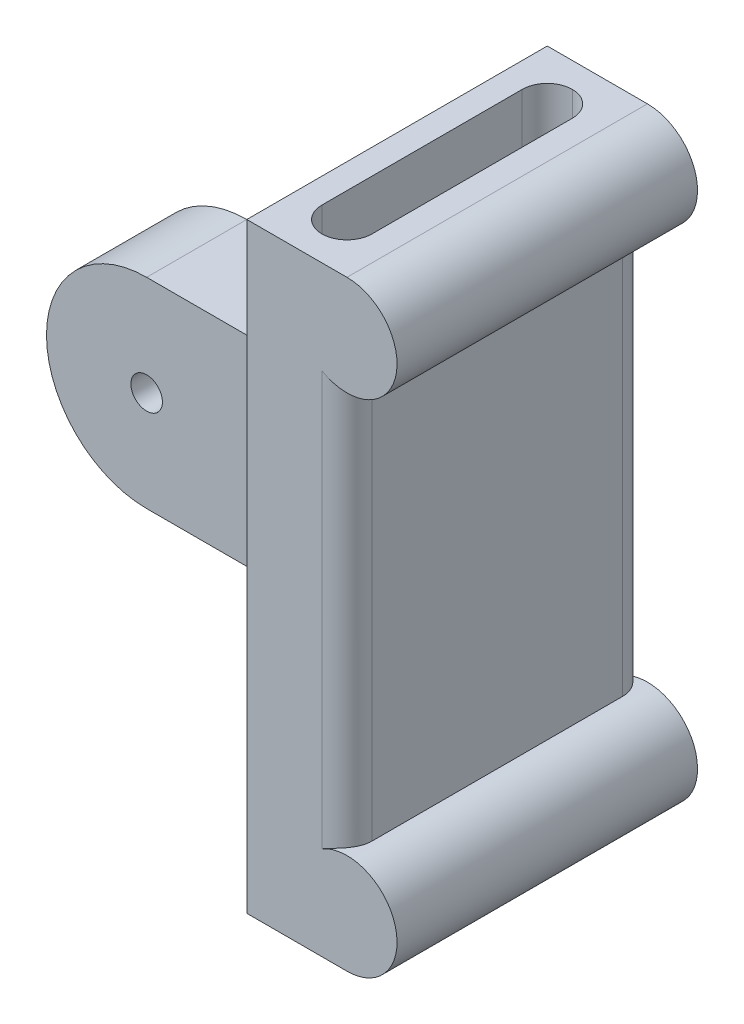
ISO-10303-21;
HEADER;
FILE_DESCRIPTION(('STEP AP214'),'2;1');
FILE_NAME('part.step','',(''),(''),'','','');
FILE_SCHEMA(('AUTOMOTIVE_DESIGN { 1 0 10303 214 1 1 1 1 }'));
ENDSEC;
DATA;
#1=APPLICATION_CONTEXT('core data for automotive mechanical design processes');
#2=APPLICATION_PROTOCOL_DEFINITION('international standard','automotive_design',2000,#1);
#3=PRODUCT_CONTEXT('',#1,'mechanical');
#4=PRODUCT('Part','Part','',(#3));
#5=PRODUCT_RELATED_PRODUCT_CATEGORY('part','',(#4));
#6=PRODUCT_DEFINITION_FORMATION('','',#4);
#7=PRODUCT_DEFINITION_CONTEXT('part definition',#1,'design');
#8=PRODUCT_DEFINITION('design','',#6,#7);
#9=PRODUCT_DEFINITION_SHAPE('','',#8);
#10=(LENGTH_UNIT() NAMED_UNIT(*) SI_UNIT(.MILLI.,.METRE.));
#11=(NAMED_UNIT(*) PLANE_ANGLE_UNIT() SI_UNIT($,.RADIAN.));
#12=(NAMED_UNIT(*) SI_UNIT($,.STERADIAN.) SOLID_ANGLE_UNIT());
#13=UNCERTAINTY_MEASURE_WITH_UNIT(LENGTH_MEASURE(1.E-05),#10,'distance_accuracy_value','');
#14=(GEOMETRIC_REPRESENTATION_CONTEXT(3) GLOBAL_UNCERTAINTY_ASSIGNED_CONTEXT((#13)) GLOBAL_UNIT_ASSIGNED_CONTEXT((#10,
#11,#12)) REPRESENTATION_CONTEXT('',''));
#15=CARTESIAN_POINT('',(0.,0.,0.));
#16=DIRECTION('',(0.,0.,1.));
#17=DIRECTION('',(1.,0.,0.));
#18=AXIS2_PLACEMENT_3D('',#15,#16,#17);
#19=CARTESIAN_POINT('',(25.4,0.,0.));
#20=DIRECTION('',(1.,0.,0.));
#21=DIRECTION('',(0.,0.,-1.));
#22=AXIS2_PLACEMENT_3D('',#19,#20,#21);
#23=PLANE('',#22);
#24=DIRECTION('',(0.,-1.,0.));
#25=VECTOR('',#24,1.);
#26=CARTESIAN_POINT('',(25.4,38.1,25.4));
#27=LINE('',#26,#25);
#28=CARTESIAN_POINT('',(25.4,-25.4,25.4));
#29=VERTEX_POINT('',#28);
#30=CARTESIAN_POINT('',(25.4,-38.1,25.4));
#31=VERTEX_POINT('',#30);
#32=EDGE_CURVE('E179',#29,#31,#27,.T.);
#33=ORIENTED_EDGE('',*,*,#32,.F.);
#34=DIRECTION('',(0.,0.,-1.));
#35=VECTOR('',#34,1.);
#36=CARTESIAN_POINT('',(25.4,-25.4,0.));
#37=LINE('',#36,#35);
#38=CARTESIAN_POINT('',(25.4,-25.4,-12.7));
#39=VERTEX_POINT('',#38);
#40=EDGE_CURVE('E278',#29,#39,#37,.T.);
#41=ORIENTED_EDGE('',*,*,#40,.T.);
#42=DIRECTION('',(0.,-1.,0.));
#43=VECTOR('',#42,1.);
#44=CARTESIAN_POINT('',(25.4,38.1,-12.7));
#45=LINE('',#44,#43);
#46=CARTESIAN_POINT('',(25.4,-38.1,-12.7));
#47=VERTEX_POINT('',#46);
#48=EDGE_CURVE('E237',#39,#47,#45,.T.);
#49=ORIENTED_EDGE('',*,*,#48,.T.);
#50=DIRECTION('',(0.,0.,-1.));
#51=VECTOR('',#50,1.);
#52=CARTESIAN_POINT('',(25.4,-38.1,25.4));
#53=LINE('',#52,#51);
#54=EDGE_CURVE('E234',#31,#47,#53,.T.);
#55=ORIENTED_EDGE('',*,*,#54,.F.);
#56=EDGE_LOOP('',(#33,#41,#49,#55));
#57=FACE_BOUND('',#56,.T.);
#58=ADVANCED_FACE('F34',(#57),#23,.F.);
#59=CARTESIAN_POINT('',(0.,0.,12.7));
#60=DIRECTION('',(0.,0.,-1.));
#61=DIRECTION('',(-1.,0.,0.));
#62=AXIS2_PLACEMENT_3D('',#59,#60,#61);
#63=CYLINDRICAL_SURFACE('',#62,12.7);
#64=CARTESIAN_POINT('',(0.,0.,0.));
#65=DIRECTION('',(0.,0.,1.));
#66=DIRECTION('',(1.,0.,0.));
#67=AXIS2_PLACEMENT_3D('',#64,#65,#66);
#68=CIRCLE('',#67,12.7);
#69=CARTESIAN_POINT('',(0.,12.7,0.));
#70=VERTEX_POINT('',#69);
#71=CARTESIAN_POINT('',(0.,-12.7,0.));
#72=VERTEX_POINT('',#71);
#73=EDGE_CURVE('E264',#70,#72,#68,.T.);
#74=ORIENTED_EDGE('',*,*,#73,.T.);
#75=DIRECTION('',(0.,0.,-1.));
#76=VECTOR('',#75,1.);
#77=CARTESIAN_POINT('',(0.,-12.7,12.7));
#78=LINE('',#77,#76);
#79=CARTESIAN_POINT('',(0.,-12.7,12.7));
#80=VERTEX_POINT('',#79);
#81=EDGE_CURVE('E273',#80,#72,#78,.T.);
#82=ORIENTED_EDGE('',*,*,#81,.F.);
#83=CARTESIAN_POINT('',(0.,0.,12.7));
#84=DIRECTION('',(0.,0.,1.));
#85=DIRECTION('',(1.,0.,0.));
#86=AXIS2_PLACEMENT_3D('',#83,#84,#85);
#87=CIRCLE('',#86,12.7);
#88=CARTESIAN_POINT('',(0.,12.7,12.7));
#89=VERTEX_POINT('',#88);
#90=EDGE_CURVE('E251',#89,#80,#87,.T.);
#91=ORIENTED_EDGE('',*,*,#90,.F.);
#92=DIRECTION('',(0.,0.,-1.));
#93=VECTOR('',#92,1.);
#94=CARTESIAN_POINT('',(0.,12.7,12.7));
#95=LINE('',#94,#93);
#96=EDGE_CURVE('E261',#89,#70,#95,.T.);
#97=ORIENTED_EDGE('',*,*,#96,.T.);
#98=EDGE_LOOP('',(#74,#82,#91,#97));
#99=FACE_BOUND('',#98,.T.);
#100=ADVANCED_FACE('F376',(#99),#63,.T.);
#101=CARTESIAN_POINT('',(0.,-12.7,12.7));
#102=DIRECTION('',(0.,1.,0.));
#103=DIRECTION('',(0.,0.,1.));
#104=AXIS2_PLACEMENT_3D('',#101,#102,#103);
#105=PLANE('',#104);
#106=DIRECTION('',(1.,0.,0.));
#107=VECTOR('',#106,1.);
#108=CARTESIAN_POINT('',(0.,-12.7,0.));
#109=LINE('',#108,#107);
#110=CARTESIAN_POINT('',(12.7,-12.7,0.));
#111=VERTEX_POINT('',#110);
#112=EDGE_CURVE('E267',#72,#111,#109,.T.);
#113=ORIENTED_EDGE('',*,*,#112,.T.);
#114=DIRECTION('',(0.,0.,-1.));
#115=VECTOR('',#114,1.);
#116=CARTESIAN_POINT('',(12.7,-12.7,12.7));
#117=LINE('',#116,#115);
#118=CARTESIAN_POINT('',(12.7,-12.7,12.7));
#119=VERTEX_POINT('',#118);
#120=EDGE_CURVE('E281',#111,#119,#117,.F.);
#121=ORIENTED_EDGE('',*,*,#120,.T.);
#122=DIRECTION('',(1.,0.,0.));
#123=VECTOR('',#122,1.);
#124=CARTESIAN_POINT('',(0.,-12.7,12.7));
#125=LINE('',#124,#123);
#126=EDGE_CURVE('E255',#80,#119,#125,.T.);
#127=ORIENTED_EDGE('',*,*,#126,.F.);
#128=ORIENTED_EDGE('',*,*,#81,.T.);
#129=EDGE_LOOP('',(#113,#121,#127,#128));
#130=FACE_BOUND('',#129,.T.);
#131=ADVANCED_FACE('F383',(#130),#105,.F.);
#132=CARTESIAN_POINT('',(0.,0.,12.7));
#133=DIRECTION('',(0.,0.,-1.));
#134=DIRECTION('',(-1.,0.,0.));
#135=AXIS2_PLACEMENT_3D('',#132,#133,#134);
#136=CYLINDRICAL_SURFACE('',#135,2.);
#137=CARTESIAN_POINT('',(0.,0.,12.7));
#138=DIRECTION('',(0.,0.,1.));
#139=DIRECTION('',(1.,0.,0.));
#140=AXIS2_PLACEMENT_3D('',#137,#138,#139);
#141=CIRCLE('',#140,2.);
#142=CARTESIAN_POINT('',(2.,0.,12.7));
#143=VERTEX_POINT('',#142);
#144=EDGE_CURVE('E248',#143,#143,#141,.T.);
#145=ORIENTED_EDGE('',*,*,#144,.T.);
#146=EDGE_LOOP('',(#145));
#147=FACE_BOUND('',#146,.T.);
#148=CARTESIAN_POINT('',(0.,0.,0.));
#149=DIRECTION('',(0.,0.,1.));
#150=DIRECTION('',(1.,0.,0.));
#151=AXIS2_PLACEMENT_3D('',#148,#149,#150);
#152=CIRCLE('',#151,2.);
#153=CARTESIAN_POINT('',(2.,0.,0.));
#154=VERTEX_POINT('',#153);
#155=EDGE_CURVE('E183',#154,#154,#152,.T.);
#156=ORIENTED_EDGE('',*,*,#155,.F.);
#157=EDGE_LOOP('',(#156));
#158=FACE_BOUND('',#157,.T.);
#159=ADVANCED_FACE('F434',(#147,#158),#136,.F.);
#160=CARTESIAN_POINT('',(0.,12.7,12.7));
#161=DIRECTION('',(0.,1.,0.));
#162=DIRECTION('',(0.,0.,1.));
#163=AXIS2_PLACEMENT_3D('',#160,#161,#162);
#164=PLANE('',#163);
#165=DIRECTION('',(1.,0.,0.));
#166=VECTOR('',#165,1.);
#167=CARTESIAN_POINT('',(0.,12.7,12.7));
#168=LINE('',#167,#166);
#169=CARTESIAN_POINT('',(12.7,12.7,12.7));
#170=VERTEX_POINT('',#169);
#171=EDGE_CURVE('E258',#89,#170,#168,.T.);
#172=ORIENTED_EDGE('',*,*,#171,.T.);
#173=DIRECTION('',(0.,0.,-1.));
#174=VECTOR('',#173,1.);
#175=CARTESIAN_POINT('',(12.7,12.7,12.7));
#176=LINE('',#175,#174);
#177=CARTESIAN_POINT('',(12.7,12.7,0.));
#178=VERTEX_POINT('',#177);
#179=EDGE_CURVE('E286',#170,#178,#176,.T.);
#180=ORIENTED_EDGE('',*,*,#179,.T.);
#181=DIRECTION('',(1.,0.,0.));
#182=VECTOR('',#181,1.);
#183=CARTESIAN_POINT('',(0.,12.7,0.));
#184=LINE('',#183,#182);
#185=EDGE_CURVE('E252',#70,#178,#184,.T.);
#186=ORIENTED_EDGE('',*,*,#185,.F.);
#187=ORIENTED_EDGE('',*,*,#96,.F.);
#188=EDGE_LOOP('',(#172,#180,#186,#187));
#189=FACE_BOUND('',#188,.T.);
#190=ADVANCED_FACE('F431',(#189),#164,.T.);
#191=CARTESIAN_POINT('',(0.,0.,12.7));
#192=DIRECTION('',(0.,0.,1.));
#193=DIRECTION('',(1.,0.,0.));
#194=AXIS2_PLACEMENT_3D('',#191,#192,#193);
#195=PLANE('',#194);
#196=ORIENTED_EDGE('',*,*,#144,.F.);
#197=EDGE_LOOP('',(#196));
#198=FACE_BOUND('',#197,.T.);
#199=ORIENTED_EDGE('',*,*,#126,.T.);
#200=DIRECTION('',(0.,1.,0.));
#201=VECTOR('',#200,1.);
#202=CARTESIAN_POINT('',(12.7,0.,12.7));
#203=LINE('',#202,#201);
#204=EDGE_CURVE('E284',#119,#170,#203,.T.);
#205=ORIENTED_EDGE('',*,*,#204,.T.);
#206=ORIENTED_EDGE('',*,*,#171,.F.);
#207=ORIENTED_EDGE('',*,*,#90,.T.);
#208=EDGE_LOOP('',(#199,#205,#206,#207));
#209=FACE_BOUND('',#208,.T.);
#210=ADVANCED_FACE('F396',(#198,#209),#195,.T.);
#211=CARTESIAN_POINT('',(0.,0.,0.));
#212=DIRECTION('',(0.,0.,1.));
#213=DIRECTION('',(1.,0.,0.));
#214=AXIS2_PLACEMENT_3D('',#211,#212,#213);
#215=PLANE('',#214);
#216=ORIENTED_EDGE('',*,*,#155,.T.);
#217=EDGE_LOOP('',(#216));
#218=FACE_BOUND('',#217,.T.);
#219=ORIENTED_EDGE('',*,*,#185,.T.);
#220=DIRECTION('',(0.,1.,0.));
#221=VECTOR('',#220,1.);
#222=CARTESIAN_POINT('',(12.7,-12.7,0.));
#223=LINE('',#222,#221);
#224=EDGE_CURVE('E288',#178,#111,#223,.F.);
#225=ORIENTED_EDGE('',*,*,#224,.T.);
#226=ORIENTED_EDGE('',*,*,#112,.F.);
#227=ORIENTED_EDGE('',*,*,#73,.F.);
#228=EDGE_LOOP('',(#219,#225,#226,#227));
#229=FACE_BOUND('',#228,.T.);
#230=ADVANCED_FACE('F389',(#218,#229),#215,.F.);
#231=CARTESIAN_POINT('',(25.4,38.1,-12.7));
#232=VERTEX_POINT('',#231);
#233=CARTESIAN_POINT('',(25.4,25.4,-12.7));
#234=VERTEX_POINT('',#233);
#235=EDGE_CURVE('E238',#232,#234,#45,.T.);
#236=ORIENTED_EDGE('',*,*,#235,.T.);
#237=DIRECTION('',(0.,0.,-1.));
#238=VECTOR('',#237,1.);
#239=CARTESIAN_POINT('',(25.4,25.4,0.));
#240=LINE('',#239,#238);
#241=CARTESIAN_POINT('',(25.4,25.4,25.4));
#242=VERTEX_POINT('',#241);
#243=EDGE_CURVE('E276',#234,#242,#240,.F.);
#244=ORIENTED_EDGE('',*,*,#243,.T.);
#245=CARTESIAN_POINT('',(25.4,38.1,25.4));
#246=VERTEX_POINT('',#245);
#247=EDGE_CURVE('E231',#246,#242,#27,.T.);
#248=ORIENTED_EDGE('',*,*,#247,.F.);
#249=DIRECTION('',(0.,0.,-1.));
#250=VECTOR('',#249,1.);
#251=CARTESIAN_POINT('',(25.4,38.1,25.4));
#252=LINE('',#251,#250);
#253=EDGE_CURVE('E193',#246,#232,#252,.T.);
#254=ORIENTED_EDGE('',*,*,#253,.T.);
#255=EDGE_LOOP('',(#236,#244,#248,#254));
#256=FACE_BOUND('',#255,.T.);
#257=ADVANCED_FACE('F379',(#256),#23,.F.);
#258=CARTESIAN_POINT('',(38.1,38.1,25.4));
#259=DIRECTION('',(0.,0.,-1.));
#260=DIRECTION('',(0.,1.,0.));
#261=AXIS2_PLACEMENT_3D('',#258,#259,#260);
#262=PLANE('',#261);
#263=CARTESIAN_POINT('',(38.1,-31.75,25.4));
#264=DIRECTION('',(0.,0.,1.));
#265=DIRECTION('',(1.,0.,0.));
#266=AXIS2_PLACEMENT_3D('',#263,#264,#265);
#267=CIRCLE('',#266,6.35);
#268=CARTESIAN_POINT('',(38.1,-38.1,25.4));
#269=VERTEX_POINT('',#268);
#270=CARTESIAN_POINT('',(34.925,-26.2507386859688,25.4));
#271=VERTEX_POINT('',#270);
#272=EDGE_CURVE('E176',#269,#271,#267,.T.);
#273=ORIENTED_EDGE('',*,*,#272,.T.);
#274=DIRECTION('',(0.,-1.,0.));
#275=VECTOR('',#274,1.);
#276=CARTESIAN_POINT('',(34.925,25.4,25.4));
#277=LINE('',#276,#275);
#278=CARTESIAN_POINT('',(34.925,26.2507386859688,25.4));
#279=VERTEX_POINT('',#278);
#280=EDGE_CURVE('E304',#271,#279,#277,.F.);
#281=ORIENTED_EDGE('',*,*,#280,.T.);
#282=CARTESIAN_POINT('',(38.1,31.75,25.4));
#283=DIRECTION('',(0.,0.,1.));
#284=DIRECTION('',(-1.,0.,0.));
#285=AXIS2_PLACEMENT_3D('',#282,#283,#284);
#286=CIRCLE('',#285,6.35);
#287=CARTESIAN_POINT('',(38.1,38.1,25.4));
#288=VERTEX_POINT('',#287);
#289=EDGE_CURVE('E207',#279,#288,#286,.T.);
#290=ORIENTED_EDGE('',*,*,#289,.T.);
#291=DIRECTION('',(-1.,0.,0.));
#292=VECTOR('',#291,1.);
#293=CARTESIAN_POINT('',(38.1,38.1,25.4));
#294=LINE('',#293,#292);
#295=EDGE_CURVE('E230',#288,#246,#294,.T.);
#296=ORIENTED_EDGE('',*,*,#295,.T.);
#297=ORIENTED_EDGE('',*,*,#247,.T.);
#298=EDGE_CURVE('E235',#242,#29,#27,.T.);
#299=ORIENTED_EDGE('',*,*,#298,.T.);
#300=ORIENTED_EDGE('',*,*,#32,.T.);
#301=DIRECTION('',(-1.,0.,0.));
#302=VECTOR('',#301,1.);
#303=CARTESIAN_POINT('',(38.1,-38.1,25.4));
#304=LINE('',#303,#302);
#305=EDGE_CURVE('E171',#269,#31,#304,.T.);
#306=ORIENTED_EDGE('',*,*,#305,.F.);
#307=EDGE_LOOP('',(#273,#281,#290,#296,#297,#299,#300,#306));
#308=FACE_BOUND('',#307,.T.);
#309=ADVANCED_FACE('F173',(#308),#262,.F.);
#310=CARTESIAN_POINT('',(38.1,-38.1,25.4));
#311=DIRECTION('',(0.,1.,0.));
#312=DIRECTION('',(0.,0.,1.));
#313=AXIS2_PLACEMENT_3D('',#310,#311,#312);
#314=PLANE('',#313);
#315=CARTESIAN_POINT('',(31.75,-38.1,-6.35));
#316=DIRECTION('',(0.,1.,0.));
#317=DIRECTION('',(0.,0.,1.));
#318=AXIS2_PLACEMENT_3D('',#315,#316,#317);
#319=CIRCLE('',#318,3.175);
#320=CARTESIAN_POINT('',(34.925,-38.1,-6.35));
#321=VERTEX_POINT('',#320);
#322=CARTESIAN_POINT('',(31.75,-38.1,-9.525));
#323=VERTEX_POINT('',#322);
#324=EDGE_CURVE('E50',#321,#323,#319,.T.);
#325=ORIENTED_EDGE('',*,*,#324,.T.);
#326=CARTESIAN_POINT('',(31.75,-38.1,-6.35));
#327=DIRECTION('',(0.,1.,0.));
#328=DIRECTION('',(0.,0.,1.));
#329=AXIS2_PLACEMENT_3D('',#326,#327,#328);
#330=CIRCLE('',#329,3.175);
#331=CARTESIAN_POINT('',(28.575,-38.1,-6.35));
#332=VERTEX_POINT('',#331);
#333=EDGE_CURVE('E11',#323,#332,#330,.T.);
#334=ORIENTED_EDGE('',*,*,#333,.T.);
#335=DIRECTION('',(0.,0.,1.));
#336=VECTOR('',#335,1.);
#337=CARTESIAN_POINT('',(28.575,-38.1,-9.525));
#338=LINE('',#337,#336);
#339=CARTESIAN_POINT('',(28.575,-38.1,19.05));
#340=VERTEX_POINT('',#339);
#341=EDGE_CURVE('E217',#332,#340,#338,.T.);
#342=ORIENTED_EDGE('',*,*,#341,.T.);
#343=CARTESIAN_POINT('',(31.75,-38.1,19.05));
#344=DIRECTION('',(0.,1.,0.));
#345=DIRECTION('',(0.,0.,1.));
#346=AXIS2_PLACEMENT_3D('',#343,#344,#345);
#347=CIRCLE('',#346,3.175);
#348=CARTESIAN_POINT('',(31.75,-38.1,22.225));
#349=VERTEX_POINT('',#348);
#350=EDGE_CURVE('E488',#340,#349,#347,.T.);
#351=ORIENTED_EDGE('',*,*,#350,.T.);
#352=CARTESIAN_POINT('',(31.75,-38.1,19.05));
#353=DIRECTION('',(0.,1.,0.));
#354=DIRECTION('',(0.,0.,1.));
#355=AXIS2_PLACEMENT_3D('',#352,#353,#354);
#356=CIRCLE('',#355,3.175);
#357=CARTESIAN_POINT('',(34.925,-38.1,19.05));
#358=VERTEX_POINT('',#357);
#359=EDGE_CURVE('E479',#349,#358,#356,.T.);
#360=ORIENTED_EDGE('',*,*,#359,.T.);
#361=DIRECTION('',(0.,0.,-1.));
#362=VECTOR('',#361,1.);
#363=CARTESIAN_POINT('',(34.925,-38.1,-9.525));
#364=LINE('',#363,#362);
#365=EDGE_CURVE('E220',#358,#321,#364,.T.);
#366=ORIENTED_EDGE('',*,*,#365,.T.);
#367=EDGE_LOOP('',(#325,#334,#342,#351,#360,#366));
#368=FACE_BOUND('',#367,.T.);
#369=ORIENTED_EDGE('',*,*,#54,.T.);
#370=DIRECTION('',(-1.,0.,0.));
#371=VECTOR('',#370,1.);
#372=CARTESIAN_POINT('',(38.1,-38.1,-12.7));
#373=LINE('',#372,#371);
#374=CARTESIAN_POINT('',(38.1,-38.1,-12.7));
#375=VERTEX_POINT('',#374);
#376=EDGE_CURVE('E184',#375,#47,#373,.T.);
#377=ORIENTED_EDGE('',*,*,#376,.F.);
#378=DIRECTION('',(0.,0.,-1.));
#379=VECTOR('',#378,1.);
#380=CARTESIAN_POINT('',(38.1,-38.1,25.4));
#381=LINE('',#380,#379);
#382=EDGE_CURVE('E187',#269,#375,#381,.T.);
#383=ORIENTED_EDGE('',*,*,#382,.F.);
#384=ORIENTED_EDGE('',*,*,#305,.T.);
#385=EDGE_LOOP('',(#369,#377,#383,#384));
#386=FACE_BOUND('',#385,.T.);
#387=ADVANCED_FACE('F188',(#368,#386),#314,.F.);
#388=CARTESIAN_POINT('',(38.1,38.1,-12.7));
#389=DIRECTION('',(0.,0.,-1.));
#390=DIRECTION('',(0.,1.,0.));
#391=AXIS2_PLACEMENT_3D('',#388,#389,#390);
#392=PLANE('',#391);
#393=DIRECTION('',(0.,-1.,0.));
#394=VECTOR('',#393,1.);
#395=CARTESIAN_POINT('',(34.925,38.1,-12.7));
#396=LINE('',#395,#394);
#397=CARTESIAN_POINT('',(34.925,26.2507386859688,-12.7));
#398=VERTEX_POINT('',#397);
#399=CARTESIAN_POINT('',(34.925,-26.2507386859688,-12.7));
#400=VERTEX_POINT('',#399);
#401=EDGE_CURVE('E306',#398,#400,#396,.T.);
#402=ORIENTED_EDGE('',*,*,#401,.T.);
#403=CARTESIAN_POINT('',(38.1,-31.75,-12.7));
#404=DIRECTION('',(0.,0.,1.));
#405=DIRECTION('',(1.,0.,0.));
#406=AXIS2_PLACEMENT_3D('',#403,#404,#405);
#407=CIRCLE('',#406,6.35);
#408=EDGE_CURVE('E199',#375,#400,#407,.T.);
#409=ORIENTED_EDGE('',*,*,#408,.F.);
#410=ORIENTED_EDGE('',*,*,#376,.T.);
#411=ORIENTED_EDGE('',*,*,#48,.F.);
#412=EDGE_CURVE('E241',#234,#39,#45,.T.);
#413=ORIENTED_EDGE('',*,*,#412,.F.);
#414=ORIENTED_EDGE('',*,*,#235,.F.);
#415=DIRECTION('',(-1.,0.,0.));
#416=VECTOR('',#415,1.);
#417=CARTESIAN_POINT('',(38.1,38.1,-12.7));
#418=LINE('',#417,#416);
#419=CARTESIAN_POINT('',(38.1,38.1,-12.7));
#420=VERTEX_POINT('',#419);
#421=EDGE_CURVE('E245',#420,#232,#418,.T.);
#422=ORIENTED_EDGE('',*,*,#421,.F.);
#423=CARTESIAN_POINT('',(38.1,31.75,-12.7));
#424=DIRECTION('',(0.,0.,1.));
#425=DIRECTION('',(-1.,0.,0.));
#426=AXIS2_PLACEMENT_3D('',#423,#424,#425);
#427=CIRCLE('',#426,6.35);
#428=EDGE_CURVE('E208',#398,#420,#427,.T.);
#429=ORIENTED_EDGE('',*,*,#428,.F.);
#430=EDGE_LOOP('',(#402,#409,#410,#411,#413,#414,#422,#429));
#431=FACE_BOUND('',#430,.T.);
#432=ADVANCED_FACE('F463',(#431),#392,.T.);
#433=CARTESIAN_POINT('',(38.1,38.1,25.4));
#434=DIRECTION('',(0.,1.,0.));
#435=DIRECTION('',(0.,0.,1.));
#436=AXIS2_PLACEMENT_3D('',#433,#434,#435);
#437=PLANE('',#436);
#438=DIRECTION('',(0.,0.,1.));
#439=VECTOR('',#438,1.);
#440=CARTESIAN_POINT('',(28.575,38.1,-9.525));
#441=LINE('',#440,#439);
#442=CARTESIAN_POINT('',(28.575,38.1,-6.35));
#443=VERTEX_POINT('',#442);
#444=CARTESIAN_POINT('',(28.575,38.1,19.05));
#445=VERTEX_POINT('',#444);
#446=EDGE_CURVE('E216',#443,#445,#441,.T.);
#447=ORIENTED_EDGE('',*,*,#446,.F.);
#448=CARTESIAN_POINT('',(31.75,38.1,-6.35));
#449=DIRECTION('',(0.,1.,0.));
#450=DIRECTION('',(0.,0.,1.));
#451=AXIS2_PLACEMENT_3D('',#448,#449,#450);
#452=CIRCLE('',#451,3.175);
#453=CARTESIAN_POINT('',(31.75,38.1,-9.525));
#454=VERTEX_POINT('',#453);
#455=EDGE_CURVE('E43',#443,#454,#452,.F.);
#456=ORIENTED_EDGE('',*,*,#455,.T.);
#457=CARTESIAN_POINT('',(31.75,38.1,-6.35));
#458=DIRECTION('',(0.,1.,0.));
#459=DIRECTION('',(0.,0.,1.));
#460=AXIS2_PLACEMENT_3D('',#457,#458,#459);
#461=CIRCLE('',#460,3.175);
#462=CARTESIAN_POINT('',(34.925,38.1,-6.35));
#463=VERTEX_POINT('',#462);
#464=EDGE_CURVE('E490',#454,#463,#461,.F.);
#465=ORIENTED_EDGE('',*,*,#464,.T.);
#466=DIRECTION('',(0.,0.,-1.));
#467=VECTOR('',#466,1.);
#468=CARTESIAN_POINT('',(34.925,38.1,-9.525));
#469=LINE('',#468,#467);
#470=CARTESIAN_POINT('',(34.925,38.1,19.05));
#471=VERTEX_POINT('',#470);
#472=EDGE_CURVE('E221',#471,#463,#469,.T.);
#473=ORIENTED_EDGE('',*,*,#472,.F.);
#474=CARTESIAN_POINT('',(31.75,38.1,19.05));
#475=DIRECTION('',(0.,1.,0.));
#476=DIRECTION('',(0.,0.,1.));
#477=AXIS2_PLACEMENT_3D('',#474,#475,#476);
#478=CIRCLE('',#477,3.175);
#479=CARTESIAN_POINT('',(31.75,38.1,22.225));
#480=VERTEX_POINT('',#479);
#481=EDGE_CURVE('E480',#471,#480,#478,.F.);
#482=ORIENTED_EDGE('',*,*,#481,.T.);
#483=CARTESIAN_POINT('',(31.75,38.1,19.05));
#484=DIRECTION('',(0.,1.,0.));
#485=DIRECTION('',(0.,0.,1.));
#486=AXIS2_PLACEMENT_3D('',#483,#484,#485);
#487=CIRCLE('',#486,3.175);
#488=EDGE_CURVE('E483',#480,#445,#487,.F.);
#489=ORIENTED_EDGE('',*,*,#488,.T.);
#490=EDGE_LOOP('',(#447,#456,#465,#473,#482,#489));
#491=FACE_BOUND('',#490,.T.);
#492=ORIENTED_EDGE('',*,*,#253,.F.);
#493=ORIENTED_EDGE('',*,*,#295,.F.);
#494=DIRECTION('',(0.,0.,-1.));
#495=VECTOR('',#494,1.);
#496=CARTESIAN_POINT('',(38.1,38.1,25.4));
#497=LINE('',#496,#495);
#498=EDGE_CURVE('E192',#288,#420,#497,.T.);
#499=ORIENTED_EDGE('',*,*,#498,.T.);
#500=ORIENTED_EDGE('',*,*,#421,.T.);
#501=EDGE_LOOP('',(#492,#493,#499,#500));
#502=FACE_BOUND('',#501,.T.);
#503=ADVANCED_FACE('F458',(#491,#502),#437,.T.);
#504=CARTESIAN_POINT('',(38.1,0.,0.));
#505=DIRECTION('',(1.,0.,0.));
#506=DIRECTION('',(0.,0.,-1.));
#507=AXIS2_PLACEMENT_3D('',#504,#505,#506);
#508=PLANE('',#507);
#509=DIRECTION('',(0.,0.,1.));
#510=VECTOR('',#509,1.);
#511=CARTESIAN_POINT('',(38.1,25.4,-12.7));
#512=LINE('',#511,#510);
#513=CARTESIAN_POINT('',(38.1,25.4,-9.525));
#514=VERTEX_POINT('',#513);
#515=CARTESIAN_POINT('',(38.1,25.4,22.225));
#516=VERTEX_POINT('',#515);
#517=EDGE_CURVE('E211',#514,#516,#512,.T.);
#518=ORIENTED_EDGE('',*,*,#517,.T.);
#519=DIRECTION('',(0.,-1.,0.));
#520=VECTOR('',#519,1.);
#521=CARTESIAN_POINT('',(38.1,-25.4,22.225));
#522=LINE('',#521,#520);
#523=CARTESIAN_POINT('',(38.1,-25.4,22.225));
#524=VERTEX_POINT('',#523);
#525=EDGE_CURVE('E301',#516,#524,#522,.T.);
#526=ORIENTED_EDGE('',*,*,#525,.T.);
#527=DIRECTION('',(0.,0.,1.));
#528=VECTOR('',#527,1.);
#529=CARTESIAN_POINT('',(38.1,-25.4,-12.7));
#530=LINE('',#529,#528);
#531=CARTESIAN_POINT('',(38.1,-25.4,-9.52500000000001));
#532=VERTEX_POINT('',#531);
#533=EDGE_CURVE('E202',#532,#524,#530,.T.);
#534=ORIENTED_EDGE('',*,*,#533,.F.);
#535=DIRECTION('',(0.,-1.,0.));
#536=VECTOR('',#535,1.);
#537=CARTESIAN_POINT('',(38.1,0.,-9.525));
#538=LINE('',#537,#536);
#539=EDGE_CURVE('E290',#532,#514,#538,.F.);
#540=ORIENTED_EDGE('',*,*,#539,.T.);
#541=EDGE_LOOP('',(#518,#526,#534,#540));
#542=FACE_BOUND('',#541,.T.);
#543=ADVANCED_FACE('F454',(#542),#508,.T.);
#544=CARTESIAN_POINT('',(12.7,25.4,12.7));
#545=DIRECTION('',(0.,0.,-1.));
#546=DIRECTION('',(-1.,0.,0.));
#547=AXIS2_PLACEMENT_3D('',#544,#545,#546);
#548=CYLINDRICAL_SURFACE('',#547,12.7);
#549=CARTESIAN_POINT('',(12.7,25.4,-12.7));
#550=DIRECTION('',(0.,-0.707106781186547,-0.707106781186547));
#551=DIRECTION('',(0.,-0.707106781186547,0.707106781186547));
#552=AXIS2_PLACEMENT_3D('',#549,#550,#551);
#553=ELLIPSE('',#552,17.9605122421383,12.7);
#554=EDGE_CURVE('E294',#178,#234,#553,.F.);
#555=ORIENTED_EDGE('',*,*,#554,.F.);
#556=ORIENTED_EDGE('',*,*,#179,.F.);
#557=CARTESIAN_POINT('',(12.7,25.4,25.4));
#558=DIRECTION('',(0.,0.707106781186547,-0.707106781186547));
#559=DIRECTION('',(0.,-0.707106781186547,-0.707106781186547));
#560=AXIS2_PLACEMENT_3D('',#557,#558,#559);
#561=ELLIPSE('',#560,17.9605122421383,12.7);
#562=EDGE_CURVE('E297',#242,#170,#561,.T.);
#563=ORIENTED_EDGE('',*,*,#562,.F.);
#564=ORIENTED_EDGE('',*,*,#243,.F.);
#565=EDGE_LOOP('',(#555,#556,#563,#564));
#566=FACE_BOUND('',#565,.T.);
#567=ADVANCED_FACE('F407',(#566),#548,.F.);
#568=CARTESIAN_POINT('',(12.7,0.,25.4));
#569=DIRECTION('',(0.,1.,0.));
#570=DIRECTION('',(0.,0.,1.));
#571=AXIS2_PLACEMENT_3D('',#568,#569,#570);
#572=CYLINDRICAL_SURFACE('',#571,12.7);
#573=ORIENTED_EDGE('',*,*,#562,.T.);
#574=ORIENTED_EDGE('',*,*,#204,.F.);
#575=CARTESIAN_POINT('',(12.7,-25.4,25.4));
#576=DIRECTION('',(0.,0.707106781186547,0.707106781186547));
#577=DIRECTION('',(0.,0.707106781186547,-0.707106781186547));
#578=AXIS2_PLACEMENT_3D('',#575,#576,#577);
#579=ELLIPSE('',#578,17.9605122421383,12.7);
#580=EDGE_CURVE('E292',#29,#119,#579,.T.);
#581=ORIENTED_EDGE('',*,*,#580,.F.);
#582=ORIENTED_EDGE('',*,*,#298,.F.);
#583=EDGE_LOOP('',(#573,#574,#581,#582));
#584=FACE_BOUND('',#583,.T.);
#585=ADVANCED_FACE('F427',(#584),#572,.F.);
#586=CARTESIAN_POINT('',(12.7,0.,-12.7));
#587=DIRECTION('',(0.,-1.,0.));
#588=DIRECTION('',(0.,0.,-1.));
#589=AXIS2_PLACEMENT_3D('',#586,#587,#588);
#590=CYLINDRICAL_SURFACE('',#589,12.7);
#591=ORIENTED_EDGE('',*,*,#554,.T.);
#592=ORIENTED_EDGE('',*,*,#412,.T.);
#593=CARTESIAN_POINT('',(12.7,-25.4,-12.7));
#594=DIRECTION('',(0.,-0.707106781186547,0.707106781186547));
#595=DIRECTION('',(0.,-0.707106781186547,-0.707106781186547));
#596=AXIS2_PLACEMENT_3D('',#593,#594,#595);
#597=ELLIPSE('',#596,17.9605122421383,12.7);
#598=EDGE_CURVE('E223',#111,#39,#597,.F.);
#599=ORIENTED_EDGE('',*,*,#598,.F.);
#600=ORIENTED_EDGE('',*,*,#224,.F.);
#601=EDGE_LOOP('',(#591,#592,#599,#600));
#602=FACE_BOUND('',#601,.T.);
#603=ADVANCED_FACE('F413',(#602),#590,.F.);
#604=CARTESIAN_POINT('',(12.7,-25.4,0.));
#605=DIRECTION('',(0.,0.,1.));
#606=DIRECTION('',(1.,0.,0.));
#607=AXIS2_PLACEMENT_3D('',#604,#605,#606);
#608=CYLINDRICAL_SURFACE('',#607,12.7);
#609=ORIENTED_EDGE('',*,*,#580,.T.);
#610=ORIENTED_EDGE('',*,*,#120,.F.);
#611=ORIENTED_EDGE('',*,*,#598,.T.);
#612=ORIENTED_EDGE('',*,*,#40,.F.);
#613=EDGE_LOOP('',(#609,#610,#611,#612));
#614=FACE_BOUND('',#613,.T.);
#615=ADVANCED_FACE('F422',(#614),#608,.F.);
#616=CARTESIAN_POINT('',(28.575,-38.1,-9.525));
#617=DIRECTION('',(-1.,0.,0.));
#618=DIRECTION('',(0.,0.,1.));
#619=AXIS2_PLACEMENT_3D('',#616,#617,#618);
#620=PLANE('',#619);
#621=ORIENTED_EDGE('',*,*,#446,.T.);
#622=DIRECTION('',(0.,1.,0.));
#623=VECTOR('',#622,1.);
#624=CARTESIAN_POINT('',(28.575,-38.1,19.05));
#625=LINE('',#624,#623);
#626=EDGE_CURVE('E317',#445,#340,#625,.F.);
#627=ORIENTED_EDGE('',*,*,#626,.T.);
#628=ORIENTED_EDGE('',*,*,#341,.F.);
#629=DIRECTION('',(0.,1.,0.));
#630=VECTOR('',#629,1.);
#631=CARTESIAN_POINT('',(28.575,38.1,-6.35));
#632=LINE('',#631,#630);
#633=EDGE_CURVE('E315',#332,#443,#632,.T.);
#634=ORIENTED_EDGE('',*,*,#633,.T.);
#635=EDGE_LOOP('',(#621,#627,#628,#634));
#636=FACE_BOUND('',#635,.T.);
#637=ADVANCED_FACE('F449',(#636),#620,.F.);
#638=CARTESIAN_POINT('',(34.925,-38.1,-9.525));
#639=DIRECTION('',(1.,0.,0.));
#640=DIRECTION('',(0.,0.,-1.));
#641=AXIS2_PLACEMENT_3D('',#638,#639,#640);
#642=PLANE('',#641);
#643=ORIENTED_EDGE('',*,*,#365,.F.);
#644=DIRECTION('',(0.,1.,0.));
#645=VECTOR('',#644,1.);
#646=CARTESIAN_POINT('',(34.925,38.1,19.05));
#647=LINE('',#646,#645);
#648=EDGE_CURVE('E312',#358,#471,#647,.T.);
#649=ORIENTED_EDGE('',*,*,#648,.T.);
#650=ORIENTED_EDGE('',*,*,#472,.T.);
#651=DIRECTION('',(0.,1.,0.));
#652=VECTOR('',#651,1.);
#653=CARTESIAN_POINT('',(34.925,-38.1,-6.35));
#654=LINE('',#653,#652);
#655=EDGE_CURVE('E309',#463,#321,#654,.F.);
#656=ORIENTED_EDGE('',*,*,#655,.T.);
#657=EDGE_LOOP('',(#643,#649,#650,#656));
#658=FACE_BOUND('',#657,.T.);
#659=ADVANCED_FACE('F466',(#658),#642,.F.);
#660=CARTESIAN_POINT('',(38.1,31.75,-12.7));
#661=DIRECTION('',(0.,0.,1.));
#662=DIRECTION('',(1.,0.,0.));
#663=AXIS2_PLACEMENT_3D('',#660,#661,#662);
#664=CYLINDRICAL_SURFACE('',#663,6.35);
#665=ORIENTED_EDGE('',*,*,#289,.F.);
#666=CARTESIAN_POINT('',(34.925,26.2507386859688,25.4));
#667=CARTESIAN_POINT('',(35.0014688478989,26.2065730576484,25.4000091945219));
#668=CARTESIAN_POINT('',(35.0788943690504,26.1640142418901,25.3972371960424));
#669=CARTESIAN_POINT('',(35.2351481296373,26.0822972855654,25.3857845594327));
#670=CARTESIAN_POINT('',(35.3139772039505,26.0431412564472,25.3771002818065));
#671=CARTESIAN_POINT('',(35.472539136579,25.9684213079045,25.3534599767392));
#672=CARTESIAN_POINT('',(35.5522730743464,25.9328623253058,25.3384954710335));
#673=CARTESIAN_POINT('',(35.7118424029544,25.8655547056835,25.3020438769572));
#674=CARTESIAN_POINT('',(35.7916777675084,25.8338052291067,25.2805582294381));
#675=CARTESIAN_POINT('',(35.9510395579603,25.7740700122194,25.2308047547665));
#676=CARTESIAN_POINT('',(36.030563498005,25.7460997189824,25.2025103333544));
#677=CARTESIAN_POINT('',(36.188207280936,25.6940572517014,25.1391299305114));
#678=CARTESIAN_POINT('',(36.266326583327,25.6699865508169,25.1040413933863));
#679=CARTESIAN_POINT('',(36.4201730359093,25.6256980195867,25.0272234266252));
#680=CARTESIAN_POINT('',(36.4959044197941,25.6054730084103,24.9855066464076));
#681=CARTESIAN_POINT('',(36.6443425663701,25.5686229069274,24.8955866856605));
#682=CARTESIAN_POINT('',(36.7170482208822,25.5519991263655,24.8473811555142));
#683=CARTESIAN_POINT('',(36.9210465164813,25.5089234078668,24.6995482243094));
#684=CARTESIAN_POINT('',(37.0476165677514,25.4866893911805,24.5919883212991));
#685=CARTESIAN_POINT('',(37.2829945198976,25.451647295346,24.3576365919974));
#686=CARTESIAN_POINT('',(37.3917911281068,25.4388451909393,24.2308326365838));
#687=CARTESIAN_POINT('',(37.5899363550393,25.4197223319442,23.9592048870609));
#688=CARTESIAN_POINT('',(37.6789357983887,25.4135116044797,23.8141190911504));
#689=CARTESIAN_POINT('',(37.8326601502449,25.4051596061799,23.5114384745552));
#690=CARTESIAN_POINT('',(37.8973847105144,25.4030183937224,23.3538434744579));
#691=CARTESIAN_POINT('',(37.9740403814538,25.4012023816103,23.1142210659499));
#692=CARTESIAN_POINT('',(37.9959633481013,25.4008247299583,23.0352621866236));
#693=CARTESIAN_POINT('',(38.0336481688986,25.4003183228271,22.8758680263671));
#694=CARTESIAN_POINT('',(38.0494101438352,25.4001895624681,22.7954327744136));
#695=CARTESIAN_POINT('',(38.0746663416243,25.4000373835837,22.6335791023419));
#696=CARTESIAN_POINT('',(38.0841597957762,25.4000139779756,22.5521605628905));
#697=CARTESIAN_POINT('',(38.0968297917451,25.40000025003,22.3888290945794));
#698=CARTESIAN_POINT('',(38.100005989278,25.4000099294954,22.3069161390186));
#699=CARTESIAN_POINT('',(38.1,25.4,22.225));
#700=B_SPLINE_CURVE_WITH_KNOTS('',3,(#666,#667,#668,#669,#670,#671,#672,#673,#674,#675,#676,
#677,#678,#679,#680,#681,#682,#683,#684,#685,#686,#687,#688,#689,#690,#691,#692,#693,#694,#695,
#696,#697,#698,#699),.UNSPECIFIED.,.F.,.F.,(4,2,2,2,2,2,2,2,2,2,2,2,2,2,2,2,4),(0.,
0.264894171229058,0.529951554312933,0.795367919970224,1.06072568431108,1.32713722559758,
1.59364917639277,1.85965849016002,2.12576438798715,2.62595092030369,3.12645402912054,
3.63518639972131,4.14392606810423,4.38956838341652,4.63520588264551,4.88087349848947,
5.12655450260351),.UNSPECIFIED.);
#701=EDGE_CURVE('E326',#279,#516,#700,.T.);
#702=ORIENTED_EDGE('',*,*,#701,.T.);
#703=ORIENTED_EDGE('',*,*,#517,.F.);
#704=CARTESIAN_POINT('',(38.1,25.4,-9.525));
#705=CARTESIAN_POINT('',(38.1000084471264,25.4000138907502,-9.61408045099457));
#706=CARTESIAN_POINT('',(38.0962510468015,25.4000003604333,-9.70315683229325));
#707=CARTESIAN_POINT('',(38.081269966129,25.4000195329368,-9.88067631761056));
#708=CARTESIAN_POINT('',(38.070046565668,25.400052234024,-9.96911944524307));
#709=CARTESIAN_POINT('',(38.0402034174599,25.4002648982335,-10.1447274186003));
#710=CARTESIAN_POINT('',(38.0215859143551,25.4004448166823,-10.2318926439413));
#711=CARTESIAN_POINT('',(37.977105697498,25.4011507585319,-10.4043265912345));
#712=CARTESIAN_POINT('',(37.9512430737195,25.4016767776348,-10.489595336724));
#713=CARTESIAN_POINT('',(37.8629881395608,25.4041470758265,-10.7417586505603));
#714=CARTESIAN_POINT('',(37.7899207402857,25.406983402044,-10.9050572765728));
#715=CARTESIAN_POINT('',(37.6175698900072,25.4177679252146,-11.2168798783184));
#716=CARTESIAN_POINT('',(37.5182906352637,25.4257153042307,-11.3654062137147));
#717=CARTESIAN_POINT('',(37.297774274115,25.449914389315,-11.6419544197478));
#718=CARTESIAN_POINT('',(37.1767728280607,25.466080083945,-11.7701709743641));
#719=CARTESIAN_POINT('',(36.9164737698162,25.509879424111,-12.0039541682966));
#720=CARTESIAN_POINT('',(36.7771907208794,25.5375039788853,-12.1095386620229));
#721=CARTESIAN_POINT('',(36.4917689003518,25.6053507068117,-12.291467140456));
#722=CARTESIAN_POINT('',(36.3461452787623,25.645009997198,-12.3688324203032));
#723=CARTESIAN_POINT('',(36.0483795539085,25.7385400849585,-12.4990618153418));
#724=CARTESIAN_POINT('',(35.8962309849875,25.7924252648439,-12.5519009844342));
#725=CARTESIAN_POINT('',(35.6746921670697,25.8809295770736,-12.6110569379536));
#726=CARTESIAN_POINT('',(35.605477295708,25.9100022771599,-12.627022273779));
#727=CARTESIAN_POINT('',(35.4673212500918,25.9709699990548,-12.6541304057289));
#728=CARTESIAN_POINT('',(35.3983800930032,26.0028651950419,-12.6652729039817));
#729=CARTESIAN_POINT('',(35.2613680131256,26.0692912210192,-12.682886193163));
#730=CARTESIAN_POINT('',(35.1932955698258,26.1038163895841,-12.6893667220516));
#731=CARTESIAN_POINT('',(35.0582459300146,26.1754063888271,-12.6979248464298));
#732=CARTESIAN_POINT('',(34.9912683574126,26.2124703237184,-12.7000039867427));
#733=CARTESIAN_POINT('',(34.925,26.2507386859688,-12.7));
#734=B_SPLINE_CURVE_WITH_KNOTS('',3,(#704,#705,#706,#707,#708,#709,#710,#711,#712,#713,#714,
#715,#716,#717,#718,#719,#720,#721,#722,#723,#724,#725,#726,#727,#728,#729,#730,#731,#732,#733),
.UNSPECIFIED.,.F.,.F.,(4,2,2,2,2,2,2,2,2,2,2,2,2,2,4),(0.,0.267154778306252,0.534299542037799,
0.801363270022247,1.06842368161618,1.6024033203857,2.13629752605328,2.66471571484431,
3.19271548817525,3.69906927669093,4.20593696734065,4.43603364095956,4.66614452395036,
4.89577334265123,5.12532155161122),.UNSPECIFIED.);
#735=EDGE_CURVE('E349',#514,#398,#734,.T.);
#736=ORIENTED_EDGE('',*,*,#735,.T.);
#737=ORIENTED_EDGE('',*,*,#428,.T.);
#738=ORIENTED_EDGE('',*,*,#498,.F.);
#739=EDGE_LOOP('',(#665,#702,#703,#736,#737,#738));
#740=FACE_BOUND('',#739,.T.);
#741=ADVANCED_FACE('F339',(#740),#664,.T.);
#742=CARTESIAN_POINT('',(38.1,-31.75,-12.7));
#743=DIRECTION('',(0.,0.,1.));
#744=DIRECTION('',(1.,0.,0.));
#745=AXIS2_PLACEMENT_3D('',#742,#743,#744);
#746=CYLINDRICAL_SURFACE('',#745,6.35);
#747=ORIENTED_EDGE('',*,*,#272,.F.);
#748=ORIENTED_EDGE('',*,*,#382,.T.);
#749=ORIENTED_EDGE('',*,*,#408,.T.);
#750=CARTESIAN_POINT('',(34.925,-26.2507386859688,-12.7));
#751=CARTESIAN_POINT('',(35.0014688478989,-26.2065730576484,-12.7000091945219));
#752=CARTESIAN_POINT('',(35.0788943690504,-26.1640142418901,-12.6972371960424));
#753=CARTESIAN_POINT('',(35.2351481296373,-26.0822972855654,-12.6857845594327));
#754=CARTESIAN_POINT('',(35.3139772039505,-26.0431412564472,-12.6771002818065));
#755=CARTESIAN_POINT('',(35.472539136579,-25.9684213079045,-12.6534599767393));
#756=CARTESIAN_POINT('',(35.5522730743464,-25.9328623253058,-12.6384954710335));
#757=CARTESIAN_POINT('',(35.7118424029544,-25.8655547056835,-12.6020438769572));
#758=CARTESIAN_POINT('',(35.7916777675084,-25.8338052291067,-12.5805582294381));
#759=CARTESIAN_POINT('',(35.9510395579603,-25.7740700122194,-12.5308047547665));
#760=CARTESIAN_POINT('',(36.030563498005,-25.7460997189824,-12.5025103333544));
#761=CARTESIAN_POINT('',(36.188207280936,-25.6940572517014,-12.4391299305114));
#762=CARTESIAN_POINT('',(36.266326583327,-25.6699865508169,-12.4040413933863));
#763=CARTESIAN_POINT('',(36.4201730359093,-25.6256980195867,-12.3272234266252));
#764=CARTESIAN_POINT('',(36.4959044197941,-25.6054730084103,-12.2855066464077));
#765=CARTESIAN_POINT('',(36.6443425663701,-25.5686229069274,-12.1955866856605));
#766=CARTESIAN_POINT('',(36.7170482208822,-25.5519991263655,-12.1473811555142));
#767=CARTESIAN_POINT('',(36.9210465164813,-25.5089234078669,-11.9995482243095));
#768=CARTESIAN_POINT('',(37.0476165677514,-25.4866893911805,-11.8919883212991));
#769=CARTESIAN_POINT('',(37.2829945198976,-25.451647295346,-11.6576365919974));
#770=CARTESIAN_POINT('',(37.3917911281068,-25.4388451909393,-11.5308326365838));
#771=CARTESIAN_POINT('',(37.5899363550393,-25.4197223319442,-11.259204887061));
#772=CARTESIAN_POINT('',(37.6789357983887,-25.4135116044797,-11.1141190911504));
#773=CARTESIAN_POINT('',(37.8326601502449,-25.4051596061799,-10.8114384745552));
#774=CARTESIAN_POINT('',(37.8973847105144,-25.4030183937224,-10.6538434744579));
#775=CARTESIAN_POINT('',(37.9740403814538,-25.4012023816103,-10.41422106595));
#776=CARTESIAN_POINT('',(37.9959633481013,-25.4008247299583,-10.3352621866236));
#777=CARTESIAN_POINT('',(38.0336481688986,-25.4003183228271,-10.1758680263671));
#778=CARTESIAN_POINT('',(38.0494101438352,-25.4001895624681,-10.0954327744137));
#779=CARTESIAN_POINT('',(38.0746663416243,-25.4000373835837,-9.93357910234193));
#780=CARTESIAN_POINT('',(38.0841597957762,-25.4000139779756,-9.8521605628905));
#781=CARTESIAN_POINT('',(38.0968297917451,-25.40000025003,-9.68882909457943));
#782=CARTESIAN_POINT('',(38.100005989278,-25.4000099294954,-9.60691613901862));
#783=CARTESIAN_POINT('',(38.1,-25.4,-9.52500000000001));
#784=B_SPLINE_CURVE_WITH_KNOTS('',3,(#750,#751,#752,#753,#754,#755,#756,#757,#758,#759,#760,
#761,#762,#763,#764,#765,#766,#767,#768,#769,#770,#771,#772,#773,#774,#775,#776,#777,#778,#779,
#780,#781,#782,#783),.UNSPECIFIED.,.F.,.F.,(4,2,2,2,2,2,2,2,2,2,2,2,2,2,2,2,4),(0.,
0.264894171229056,0.529951554312933,0.795367919970224,1.06072568431108,1.32713722559758,
1.59364917639277,1.85965849016002,2.12576438798715,2.62595092030369,3.12645402912054,
3.6351863997213,4.14392606810423,4.38956838341652,4.63520588264551,4.88087349848946,
5.12655450260351),.UNSPECIFIED.);
#785=EDGE_CURVE('E343',#400,#532,#784,.T.);
#786=ORIENTED_EDGE('',*,*,#785,.T.);
#787=ORIENTED_EDGE('',*,*,#533,.T.);
#788=CARTESIAN_POINT('',(38.1,-25.4,22.225));
#789=CARTESIAN_POINT('',(38.1000084471264,-25.4000138907502,22.3140804509946));
#790=CARTESIAN_POINT('',(38.0962510468015,-25.4000003604333,22.4031568322932));
#791=CARTESIAN_POINT('',(38.081269966129,-25.4000195329368,22.5806763176105));
#792=CARTESIAN_POINT('',(38.070046565668,-25.400052234024,22.6691194452431));
#793=CARTESIAN_POINT('',(38.0402034174599,-25.4002648982335,22.8447274186003));
#794=CARTESIAN_POINT('',(38.0215859143551,-25.4004448166823,22.9318926439413));
#795=CARTESIAN_POINT('',(37.977105697498,-25.4011507585319,23.1043265912345));
#796=CARTESIAN_POINT('',(37.9512430737195,-25.4016767776348,23.189595336724));
#797=CARTESIAN_POINT('',(37.8629881395608,-25.4041470758265,23.4417586505603));
#798=CARTESIAN_POINT('',(37.7899207402857,-25.406983402044,23.6050572765728));
#799=CARTESIAN_POINT('',(37.6175698900072,-25.4177679252146,23.9168798783184));
#800=CARTESIAN_POINT('',(37.5182906352637,-25.4257153042307,24.0654062137147));
#801=CARTESIAN_POINT('',(37.297774274115,-25.449914389315,24.3419544197478));
#802=CARTESIAN_POINT('',(37.1767728280607,-25.466080083945,24.4701709743641));
#803=CARTESIAN_POINT('',(36.9164737698162,-25.509879424111,24.7039541682966));
#804=CARTESIAN_POINT('',(36.7771907208794,-25.5375039788853,24.8095386620229));
#805=CARTESIAN_POINT('',(36.4917689003518,-25.6053507068117,24.991467140456));
#806=CARTESIAN_POINT('',(36.3461452787623,-25.645009997198,25.0688324203032));
#807=CARTESIAN_POINT('',(36.0483795539085,-25.7385400849585,25.1990618153417));
#808=CARTESIAN_POINT('',(35.8962309849875,-25.7924252648439,25.2519009844342));
#809=CARTESIAN_POINT('',(35.6746921670697,-25.8809295770736,25.3110569379536));
#810=CARTESIAN_POINT('',(35.605477295708,-25.91000227716,25.327022273779));
#811=CARTESIAN_POINT('',(35.4673212500918,-25.9709699990548,25.3541304057289));
#812=CARTESIAN_POINT('',(35.3983800930032,-26.0028651950419,25.3652729039817));
#813=CARTESIAN_POINT('',(35.2613680131256,-26.0692912210192,25.382886193163));
#814=CARTESIAN_POINT('',(35.1932955698258,-26.1038163895841,25.3893667220516));
#815=CARTESIAN_POINT('',(35.0582459300146,-26.1754063888271,25.3979248464298));
#816=CARTESIAN_POINT('',(34.9912683574126,-26.2124703237184,25.4000039867427));
#817=CARTESIAN_POINT('',(34.925,-26.2507386859688,25.4));
#818=B_SPLINE_CURVE_WITH_KNOTS('',3,(#788,#789,#790,#791,#792,#793,#794,#795,#796,#797,#798,
#799,#800,#801,#802,#803,#804,#805,#806,#807,#808,#809,#810,#811,#812,#813,#814,#815,#816,#817),
.UNSPECIFIED.,.F.,.F.,(4,2,2,2,2,2,2,2,2,2,2,2,2,2,4),(0.,0.267154778306252,0.534299542037801,
0.801363270022248,1.06842368161618,1.6024033203857,2.13629752605328,2.66471571484431,
3.19271548817525,3.69906927669093,4.20593696734065,4.43603364095956,4.66614452395035,
4.89577334265123,5.12532155161123),.UNSPECIFIED.);
#819=EDGE_CURVE('E197',#524,#271,#818,.T.);
#820=ORIENTED_EDGE('',*,*,#819,.T.);
#821=EDGE_LOOP('',(#747,#748,#749,#786,#787,#820));
#822=FACE_BOUND('',#821,.T.);
#823=ADVANCED_FACE('F195',(#822),#746,.T.);
#824=CARTESIAN_POINT('',(34.925,0.,22.225));
#825=DIRECTION('',(0.,1.,0.));
#826=DIRECTION('',(0.,0.,1.));
#827=AXIS2_PLACEMENT_3D('',#824,#825,#826);
#828=CYLINDRICAL_SURFACE('',#827,3.175);
#829=ORIENTED_EDGE('',*,*,#701,.F.);
#830=ORIENTED_EDGE('',*,*,#280,.F.);
#831=ORIENTED_EDGE('',*,*,#819,.F.);
#832=ORIENTED_EDGE('',*,*,#525,.F.);
#833=EDGE_LOOP('',(#829,#830,#831,#832));
#834=FACE_BOUND('',#833,.T.);
#835=ADVANCED_FACE('F333',(#834),#828,.T.);
#836=CARTESIAN_POINT('',(34.925,38.1,-9.525));
#837=DIRECTION('',(0.,-1.,0.));
#838=DIRECTION('',(0.,0.,-1.));
#839=AXIS2_PLACEMENT_3D('',#836,#837,#838);
#840=CYLINDRICAL_SURFACE('',#839,3.175);
#841=ORIENTED_EDGE('',*,*,#735,.F.);
#842=ORIENTED_EDGE('',*,*,#539,.F.);
#843=ORIENTED_EDGE('',*,*,#785,.F.);
#844=ORIENTED_EDGE('',*,*,#401,.F.);
#845=EDGE_LOOP('',(#841,#842,#843,#844));
#846=FACE_BOUND('',#845,.T.);
#847=ADVANCED_FACE('F355',(#846),#840,.T.);
#848=CARTESIAN_POINT('',(31.75,-38.1,19.05));
#849=DIRECTION('',(0.,-1.,0.));
#850=DIRECTION('',(0.,0.,-1.));
#851=AXIS2_PLACEMENT_3D('',#848,#849,#850);
#852=CYLINDRICAL_SURFACE('',#851,3.175);
#853=DIRECTION('',(0.,1.,0.));
#854=VECTOR('',#853,1.);
#855=CARTESIAN_POINT('',(31.75,38.1,22.225));
#856=LINE('',#855,#854);
#857=EDGE_CURVE('E200',#349,#480,#856,.T.);
#858=ORIENTED_EDGE('',*,*,#857,.F.);
#859=ORIENTED_EDGE('',*,*,#350,.F.);
#860=ORIENTED_EDGE('',*,*,#626,.F.);
#861=ORIENTED_EDGE('',*,*,#488,.F.);
#862=EDGE_LOOP('',(#858,#859,#860,#861));
#863=FACE_BOUND('',#862,.T.);
#864=ADVANCED_FACE('F359',(#863),#852,.F.);
#865=CARTESIAN_POINT('',(31.75,-38.1,19.05));
#866=DIRECTION('',(0.,-1.,0.));
#867=DIRECTION('',(0.,0.,-1.));
#868=AXIS2_PLACEMENT_3D('',#865,#866,#867);
#869=CYLINDRICAL_SURFACE('',#868,3.175);
#870=ORIENTED_EDGE('',*,*,#359,.F.);
#871=ORIENTED_EDGE('',*,*,#857,.T.);
#872=ORIENTED_EDGE('',*,*,#481,.F.);
#873=ORIENTED_EDGE('',*,*,#648,.F.);
#874=EDGE_LOOP('',(#870,#871,#872,#873));
#875=FACE_BOUND('',#874,.T.);
#876=ADVANCED_FACE('F361',(#875),#869,.F.);
#877=CARTESIAN_POINT('',(31.75,-38.1,-6.35));
#878=DIRECTION('',(0.,-1.,0.));
#879=DIRECTION('',(0.,0.,-1.));
#880=AXIS2_PLACEMENT_3D('',#877,#878,#879);
#881=CYLINDRICAL_SURFACE('',#880,3.175);
#882=ORIENTED_EDGE('',*,*,#633,.F.);
#883=ORIENTED_EDGE('',*,*,#333,.F.);
#884=DIRECTION('',(0.,1.,0.));
#885=VECTOR('',#884,1.);
#886=CARTESIAN_POINT('',(31.75,-38.1,-9.525));
#887=LINE('',#886,#885);
#888=EDGE_CURVE('E38',#454,#323,#887,.F.);
#889=ORIENTED_EDGE('',*,*,#888,.F.);
#890=ORIENTED_EDGE('',*,*,#455,.F.);
#891=EDGE_LOOP('',(#882,#883,#889,#890));
#892=FACE_BOUND('',#891,.T.);
#893=ADVANCED_FACE('F36',(#892),#881,.F.);
#894=CARTESIAN_POINT('',(31.75,-38.1,-6.35));
#895=DIRECTION('',(0.,-1.,0.));
#896=DIRECTION('',(0.,0.,-1.));
#897=AXIS2_PLACEMENT_3D('',#894,#895,#896);
#898=CYLINDRICAL_SURFACE('',#897,3.175);
#899=ORIENTED_EDGE('',*,*,#324,.F.);
#900=ORIENTED_EDGE('',*,*,#655,.F.);
#901=ORIENTED_EDGE('',*,*,#464,.F.);
#902=ORIENTED_EDGE('',*,*,#888,.T.);
#903=EDGE_LOOP('',(#899,#900,#901,#902));
#904=FACE_BOUND('',#903,.T.);
#905=ADVANCED_FACE('F368',(#904),#898,.F.);
#906=CLOSED_SHELL('',(#58,#100,#131,#159,#190,#210,#230,#257,#309,#387,#432,#503,#543,#567,#585,
#603,#615,#637,#659,#741,#823,#835,#847,#864,#876,#893,#905));
#907=MANIFOLD_SOLID_BREP('B2',#906);
#908=ADVANCED_BREP_SHAPE_REPRESENTATION('',(#18,#907),#14);
#909=SHAPE_DEFINITION_REPRESENTATION(#9,#908);
ENDSEC;
END-ISO-10303-21;
